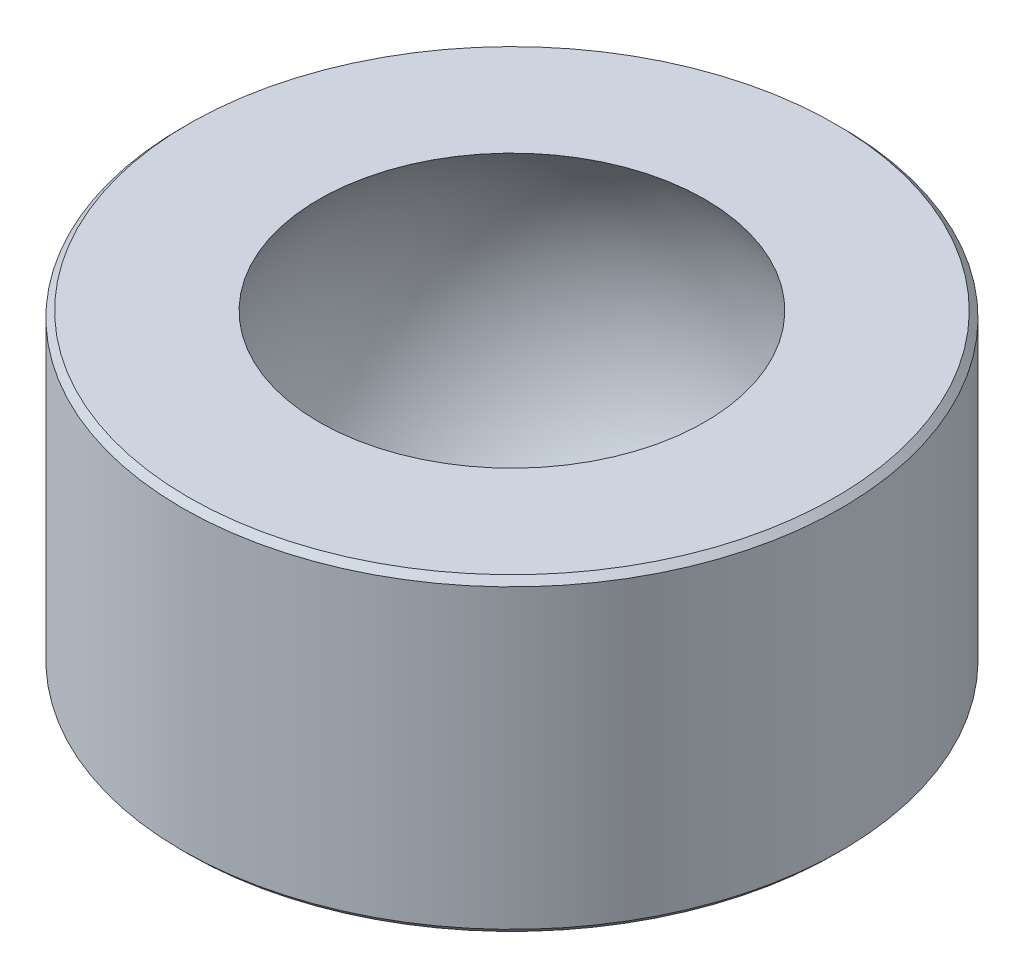
ISO-10303-21;
HEADER;
FILE_DESCRIPTION(('STEP AP214'),'2;1');
FILE_NAME('part.step','',(''),(''),'','','');
FILE_SCHEMA(('AUTOMOTIVE_DESIGN { 1 0 10303 214 1 1 1 1 }'));
ENDSEC;
DATA;
#1=APPLICATION_CONTEXT('core data for automotive mechanical design processes');
#2=APPLICATION_PROTOCOL_DEFINITION('international standard','automotive_design',2000,#1);
#3=PRODUCT_CONTEXT('',#1,'mechanical');
#4=PRODUCT('Part','Part','',(#3));
#5=PRODUCT_RELATED_PRODUCT_CATEGORY('part','',(#4));
#6=PRODUCT_DEFINITION_FORMATION('','',#4);
#7=PRODUCT_DEFINITION_CONTEXT('part definition',#1,'design');
#8=PRODUCT_DEFINITION('design','',#6,#7);
#9=PRODUCT_DEFINITION_SHAPE('','',#8);
#10=(LENGTH_UNIT() NAMED_UNIT(*) SI_UNIT(.MILLI.,.METRE.));
#11=(NAMED_UNIT(*) PLANE_ANGLE_UNIT() SI_UNIT($,.RADIAN.));
#12=(NAMED_UNIT(*) SI_UNIT($,.STERADIAN.) SOLID_ANGLE_UNIT());
#13=UNCERTAINTY_MEASURE_WITH_UNIT(LENGTH_MEASURE(1.E-05),#10,'distance_accuracy_value','');
#14=(GEOMETRIC_REPRESENTATION_CONTEXT(3) GLOBAL_UNCERTAINTY_ASSIGNED_CONTEXT((#13)) GLOBAL_UNIT_ASSIGNED_CONTEXT((#10,
#11,#12)) REPRESENTATION_CONTEXT('',''));
#15=CARTESIAN_POINT('',(0.,0.,0.));
#16=DIRECTION('',(0.,0.,1.));
#17=DIRECTION('',(1.,0.,0.));
#18=AXIS2_PLACEMENT_3D('',#15,#16,#17);
#19=CARTESIAN_POINT('',(0.,1.875,0.));
#20=DIRECTION('',(0.,1.,0.));
#21=DIRECTION('',(0.,0.,1.));
#22=AXIS2_PLACEMENT_3D('',#19,#20,#21);
#23=PLANE('',#22);
#24=CARTESIAN_POINT('',(0.,1.875,0.));
#25=DIRECTION('',(0.,1.,0.));
#26=DIRECTION('',(0.,0.,1.));
#27=AXIS2_PLACEMENT_3D('',#24,#25,#26);
#28=CIRCLE('',#27,3.925);
#29=CARTESIAN_POINT('',(0.,1.875,3.925));
#30=VERTEX_POINT('',#29);
#31=EDGE_CURVE('E10',#30,#30,#28,.T.);
#32=ORIENTED_EDGE('',*,*,#31,.T.);
#33=EDGE_LOOP('',(#32));
#34=FACE_BOUND('',#33,.T.);
#35=CARTESIAN_POINT('',(0.,1.875,0.));
#36=DIRECTION('',(0.,1.,0.));
#37=DIRECTION('',(0.,0.,1.));
#38=AXIS2_PLACEMENT_3D('',#35,#36,#37);
#39=CIRCLE('',#38,2.3418742493994);
#40=CARTESIAN_POINT('',(0.,1.875,2.3418742493994));
#41=VERTEX_POINT('',#40);
#42=EDGE_CURVE('E52',#41,#41,#39,.T.);
#43=ORIENTED_EDGE('',*,*,#42,.F.);
#44=EDGE_LOOP('',(#43));
#45=FACE_BOUND('',#44,.T.);
#46=ADVANCED_FACE('F32',(#34,#45),#23,.T.);
#47=CARTESIAN_POINT('',(0.,-1.875,0.));
#48=DIRECTION('',(0.,1.,0.));
#49=DIRECTION('',(0.,0.,1.));
#50=AXIS2_PLACEMENT_3D('',#47,#48,#49);
#51=PLANE('',#50);
#52=CARTESIAN_POINT('',(0.,-1.875,0.));
#53=DIRECTION('',(0.,1.,0.));
#54=DIRECTION('',(0.,0.,1.));
#55=AXIS2_PLACEMENT_3D('',#52,#53,#54);
#56=CIRCLE('',#55,3.925);
#57=CARTESIAN_POINT('',(0.,-1.875,3.925));
#58=VERTEX_POINT('',#57);
#59=EDGE_CURVE('E39',#58,#58,#56,.F.);
#60=ORIENTED_EDGE('',*,*,#59,.T.);
#61=EDGE_LOOP('',(#60));
#62=FACE_BOUND('',#61,.T.);
#63=CARTESIAN_POINT('',(0.,-1.875,0.));
#64=DIRECTION('',(0.,1.,0.));
#65=DIRECTION('',(0.,0.,1.));
#66=AXIS2_PLACEMENT_3D('',#63,#64,#65);
#67=CIRCLE('',#66,2.3418742493994);
#68=CARTESIAN_POINT('',(0.,-1.875,2.3418742493994));
#69=VERTEX_POINT('',#68);
#70=EDGE_CURVE('E53',#69,#69,#67,.T.);
#71=ORIENTED_EDGE('',*,*,#70,.T.);
#72=EDGE_LOOP('',(#71));
#73=FACE_BOUND('',#72,.T.);
#74=ADVANCED_FACE('F63',(#62,#73),#51,.F.);
#75=CARTESIAN_POINT('',(0.,1.875,0.));
#76=DIRECTION('',(0.,-1.,0.));
#77=DIRECTION('',(0.,0.,-1.));
#78=AXIS2_PLACEMENT_3D('',#75,#76,#77);
#79=CYLINDRICAL_SURFACE('',#78,4.);
#80=CARTESIAN_POINT('',(0.,-1.8,0.));
#81=DIRECTION('',(0.,1.,0.));
#82=DIRECTION('',(0.,0.,1.));
#83=AXIS2_PLACEMENT_3D('',#80,#81,#82);
#84=CIRCLE('',#83,4.);
#85=CARTESIAN_POINT('',(0.,-1.8,4.));
#86=VERTEX_POINT('',#85);
#87=EDGE_CURVE('E43',#86,#86,#84,.T.);
#88=ORIENTED_EDGE('',*,*,#87,.T.);
#89=EDGE_LOOP('',(#88));
#90=FACE_BOUND('',#89,.T.);
#91=CARTESIAN_POINT('',(0.,1.8,0.));
#92=DIRECTION('',(0.,1.,0.));
#93=DIRECTION('',(0.,0.,1.));
#94=AXIS2_PLACEMENT_3D('',#91,#92,#93);
#95=CIRCLE('',#94,4.);
#96=CARTESIAN_POINT('',(0.,1.8,4.));
#97=VERTEX_POINT('',#96);
#98=EDGE_CURVE('E47',#97,#97,#95,.F.);
#99=ORIENTED_EDGE('',*,*,#98,.T.);
#100=EDGE_LOOP('',(#99));
#101=FACE_BOUND('',#100,.T.);
#102=ADVANCED_FACE('F68',(#90,#101),#79,.T.);
#103=CARTESIAN_POINT('',(0.,0.,0.));
#104=DIRECTION('',(0.,0.,-1.));
#105=DIRECTION('',(1.,0.,0.));
#106=AXIS2_PLACEMENT_3D('',#103,#104,#105);
#107=SPHERICAL_SURFACE('',#106,3.);
#108=CARTESIAN_POINT('',(0.,0.,0.));
#109=DIRECTION('',(0.,1.,0.));
#110=DIRECTION('',(0.,0.,1.));
#111=AXIS2_PLACEMENT_3D('',#108,#109,#110);
#112=SPHERICAL_SURFACE('',#111,3.);
#113=ORIENTED_EDGE('',*,*,#42,.T.);
#114=EDGE_LOOP('',(#113));
#115=FACE_BOUND('',#114,.T.);
#116=ORIENTED_EDGE('',*,*,#70,.F.);
#117=EDGE_LOOP('',(#116));
#118=FACE_BOUND('',#117,.T.);
#119=ADVANCED_FACE('F59',(#115,#118),#112,.F.);
#120=CARTESIAN_POINT('',(0.,-1.8,0.));
#121=DIRECTION('',(0.,1.,0.));
#122=DIRECTION('',(0.,0.,1.));
#123=AXIS2_PLACEMENT_3D('',#120,#121,#122);
#124=CONICAL_SURFACE('',#123,4.,0.785398163397443);
#125=ORIENTED_EDGE('',*,*,#59,.F.);
#126=EDGE_LOOP('',(#125));
#127=FACE_BOUND('',#126,.T.);
#128=ORIENTED_EDGE('',*,*,#87,.F.);
#129=EDGE_LOOP('',(#128));
#130=FACE_BOUND('',#129,.T.);
#131=ADVANCED_FACE('F74',(#127,#130),#124,.T.);
#132=CARTESIAN_POINT('',(0.,1.875,0.));
#133=DIRECTION('',(0.,-1.,0.));
#134=DIRECTION('',(0.,0.,-1.));
#135=AXIS2_PLACEMENT_3D('',#132,#133,#134);
#136=CONICAL_SURFACE('',#135,3.925,0.78539816339746);
#137=ORIENTED_EDGE('',*,*,#98,.F.);
#138=EDGE_LOOP('',(#137));
#139=FACE_BOUND('',#138,.T.);
#140=ORIENTED_EDGE('',*,*,#31,.F.);
#141=EDGE_LOOP('',(#140));
#142=FACE_BOUND('',#141,.T.);
#143=ADVANCED_FACE('F34',(#139,#142),#136,.T.);
#144=CLOSED_SHELL('',(#46,#74,#102,#119,#131,#143));
#145=MANIFOLD_SOLID_BREP('B2',#144);
#146=ADVANCED_BREP_SHAPE_REPRESENTATION('',(#18,#145),#14);
#147=SHAPE_DEFINITION_REPRESENTATION(#9,#146);
ENDSEC;
END-ISO-10303-21;
